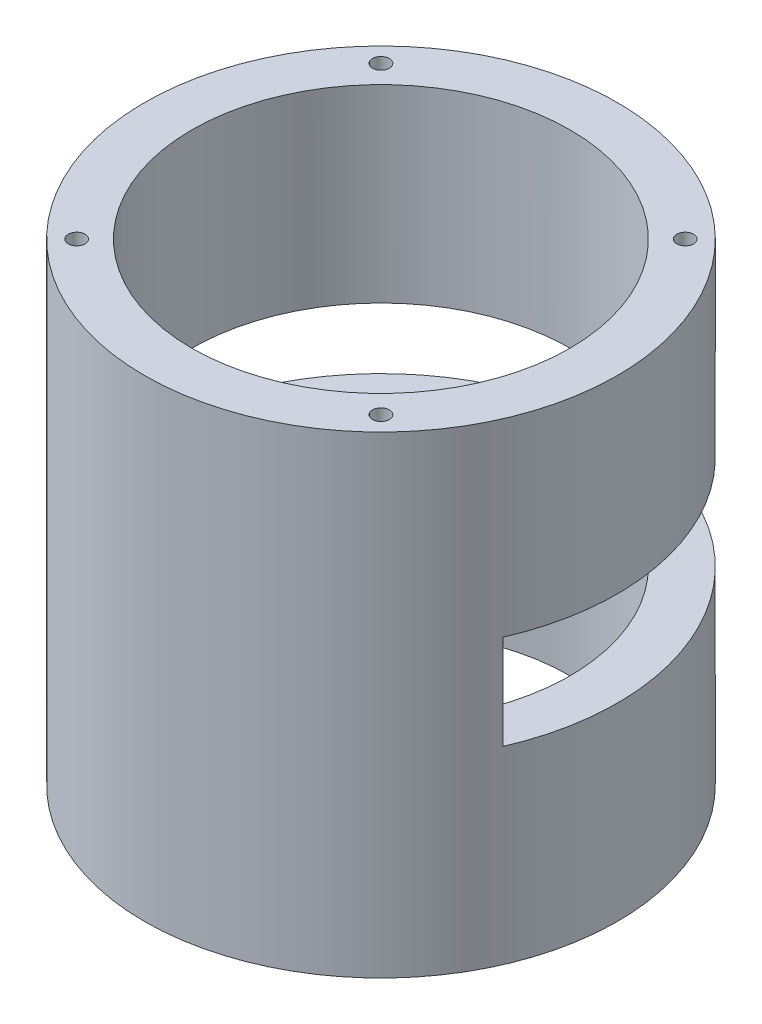
ISO-10303-21;
HEADER;
FILE_DESCRIPTION(('STEP AP214'),'2;1');
FILE_NAME('part.step','',(''),(''),'','','');
FILE_SCHEMA(('AUTOMOTIVE_DESIGN { 1 0 10303 214 1 1 1 1 }'));
ENDSEC;
DATA;
#1=APPLICATION_CONTEXT('core data for automotive mechanical design processes');
#2=APPLICATION_PROTOCOL_DEFINITION('international standard','automotive_design',2000,#1);
#3=PRODUCT_CONTEXT('',#1,'mechanical');
#4=PRODUCT('Part','Part','',(#3));
#5=PRODUCT_RELATED_PRODUCT_CATEGORY('part','',(#4));
#6=PRODUCT_DEFINITION_FORMATION('','',#4);
#7=PRODUCT_DEFINITION_CONTEXT('part definition',#1,'design');
#8=PRODUCT_DEFINITION('design','',#6,#7);
#9=PRODUCT_DEFINITION_SHAPE('','',#8);
#10=(LENGTH_UNIT() NAMED_UNIT(*) SI_UNIT(.MILLI.,.METRE.));
#11=(NAMED_UNIT(*) PLANE_ANGLE_UNIT() SI_UNIT($,.RADIAN.));
#12=(NAMED_UNIT(*) SI_UNIT($,.STERADIAN.) SOLID_ANGLE_UNIT());
#13=UNCERTAINTY_MEASURE_WITH_UNIT(LENGTH_MEASURE(1.E-05),#10,'distance_accuracy_value','');
#14=(GEOMETRIC_REPRESENTATION_CONTEXT(3) GLOBAL_UNCERTAINTY_ASSIGNED_CONTEXT((#13)) GLOBAL_UNIT_ASSIGNED_CONTEXT((#10,
#11,#12)) REPRESENTATION_CONTEXT('',''));
#15=CARTESIAN_POINT('',(0.,0.,0.));
#16=DIRECTION('',(0.,0.,1.));
#17=DIRECTION('',(1.,0.,0.));
#18=AXIS2_PLACEMENT_3D('',#15,#16,#17);
#19=CARTESIAN_POINT('',(0.,63.5,0.));
#20=DIRECTION('',(0.,1.,0.));
#21=DIRECTION('',(0.,0.,1.));
#22=AXIS2_PLACEMENT_3D('',#19,#20,#21);
#23=PLANE('',#22);
#24=CARTESIAN_POINT('',(-20.4300826754325,63.5,20.4300826754321));
#25=DIRECTION('',(0.,1.,0.));
#26=DIRECTION('',(0.,0.,1.));
#27=AXIS2_PLACEMENT_3D('',#24,#25,#26);
#28=CIRCLE('',#27,1.13029999999999);
#29=CARTESIAN_POINT('',(-20.4300826754325,63.5,21.5603826754321));
#30=VERTEX_POINT('',#29);
#31=EDGE_CURVE('E106',#30,#30,#28,.T.);
#32=ORIENTED_EDGE('',*,*,#31,.F.);
#33=EDGE_LOOP('',(#32));
#34=FACE_BOUND('',#33,.T.);
#35=CARTESIAN_POINT('',(20.4300826754322,63.5,20.4300826754324));
#36=DIRECTION('',(0.,1.,0.));
#37=DIRECTION('',(0.,0.,1.));
#38=AXIS2_PLACEMENT_3D('',#35,#36,#37);
#39=CIRCLE('',#38,1.13029999999999);
#40=CARTESIAN_POINT('',(20.4300826754322,63.5,21.5603826754324));
#41=VERTEX_POINT('',#40);
#42=EDGE_CURVE('E105',#41,#41,#39,.T.);
#43=ORIENTED_EDGE('',*,*,#42,.F.);
#44=EDGE_LOOP('',(#43));
#45=FACE_BOUND('',#44,.T.);
#46=CARTESIAN_POINT('',(20.4300826754325,63.5,-20.4300826754321));
#47=DIRECTION('',(0.,1.,0.));
#48=DIRECTION('',(0.,0.,1.));
#49=AXIS2_PLACEMENT_3D('',#46,#47,#48);
#50=CIRCLE('',#49,1.13029999999999);
#51=CARTESIAN_POINT('',(20.4300826754325,63.5,-19.2997826754321));
#52=VERTEX_POINT('',#51);
#53=EDGE_CURVE('E116',#52,#52,#50,.T.);
#54=ORIENTED_EDGE('',*,*,#53,.F.);
#55=EDGE_LOOP('',(#54));
#56=FACE_BOUND('',#55,.T.);
#57=CARTESIAN_POINT('',(-20.4300826754322,63.5,-20.4300826754324));
#58=DIRECTION('',(0.,1.,0.));
#59=DIRECTION('',(0.,0.,1.));
#60=AXIS2_PLACEMENT_3D('',#57,#58,#59);
#61=CIRCLE('',#60,1.13029999999999);
#62=CARTESIAN_POINT('',(-20.4300826754322,63.5,-19.2997826754324));
#63=VERTEX_POINT('',#62);
#64=EDGE_CURVE('E122',#63,#63,#61,.T.);
#65=ORIENTED_EDGE('',*,*,#64,.F.);
#66=EDGE_LOOP('',(#65));
#67=FACE_BOUND('',#66,.T.);
#68=CARTESIAN_POINT('',(0.,63.5,0.));
#69=DIRECTION('',(0.,1.,0.));
#70=DIRECTION('',(0.,0.,1.));
#71=AXIS2_PLACEMENT_3D('',#68,#69,#70);
#72=CIRCLE('',#71,31.75);
#73=CARTESIAN_POINT('',(0.,63.5,31.75));
#74=VERTEX_POINT('',#73);
#75=EDGE_CURVE('E173',#74,#74,#72,.T.);
#76=ORIENTED_EDGE('',*,*,#75,.T.);
#77=EDGE_LOOP('',(#76));
#78=FACE_BOUND('',#77,.T.);
#79=CARTESIAN_POINT('',(0.,63.5,0.));
#80=DIRECTION('',(0.,1.,0.));
#81=DIRECTION('',(0.,0.,1.));
#82=AXIS2_PLACEMENT_3D('',#79,#80,#81);
#83=CIRCLE('',#82,25.4);
#84=CARTESIAN_POINT('',(0.,63.5,25.4));
#85=VERTEX_POINT('',#84);
#86=EDGE_CURVE('E167',#85,#85,#83,.T.);
#87=ORIENTED_EDGE('',*,*,#86,.F.);
#88=EDGE_LOOP('',(#87));
#89=FACE_BOUND('',#88,.T.);
#90=ADVANCED_FACE('F34',(#34,#45,#56,#67,#78,#89),#23,.T.);
#91=CARTESIAN_POINT('',(0.,0.,0.));
#92=DIRECTION('',(0.,1.,0.));
#93=DIRECTION('',(0.,0.,1.));
#94=AXIS2_PLACEMENT_3D('',#91,#92,#93);
#95=PLANE('',#94);
#96=CARTESIAN_POINT('',(-20.4300826754325,0.,20.4300826754321));
#97=DIRECTION('',(0.,-1.,0.));
#98=DIRECTION('',(0.,0.,-1.));
#99=AXIS2_PLACEMENT_3D('',#96,#97,#98);
#100=CIRCLE('',#99,1.13029999999999);
#101=CARTESIAN_POINT('',(-20.4300826754325,0.,19.2997826754321));
#102=VERTEX_POINT('',#101);
#103=EDGE_CURVE('E142',#102,#102,#100,.T.);
#104=ORIENTED_EDGE('',*,*,#103,.F.);
#105=EDGE_LOOP('',(#104));
#106=FACE_BOUND('',#105,.T.);
#107=CARTESIAN_POINT('',(20.4300826754322,0.,20.4300826754324));
#108=DIRECTION('',(0.,-1.,0.));
#109=DIRECTION('',(0.,0.,-1.));
#110=AXIS2_PLACEMENT_3D('',#107,#108,#109);
#111=CIRCLE('',#110,1.13029999999999);
#112=CARTESIAN_POINT('',(20.4300826754322,0.,19.2997826754324));
#113=VERTEX_POINT('',#112);
#114=EDGE_CURVE('E148',#113,#113,#111,.T.);
#115=ORIENTED_EDGE('',*,*,#114,.F.);
#116=EDGE_LOOP('',(#115));
#117=FACE_BOUND('',#116,.T.);
#118=CARTESIAN_POINT('',(20.4300826754325,0.,-20.4300826754321));
#119=DIRECTION('',(0.,-1.,0.));
#120=DIRECTION('',(0.,0.,-1.));
#121=AXIS2_PLACEMENT_3D('',#118,#119,#120);
#122=CIRCLE('',#121,1.13029999999999);
#123=CARTESIAN_POINT('',(20.4300826754325,0.,-21.5603826754321));
#124=VERTEX_POINT('',#123);
#125=EDGE_CURVE('E154',#124,#124,#122,.T.);
#126=ORIENTED_EDGE('',*,*,#125,.F.);
#127=EDGE_LOOP('',(#126));
#128=FACE_BOUND('',#127,.T.);
#129=CARTESIAN_POINT('',(-20.4300826754322,0.,-20.4300826754324));
#130=DIRECTION('',(0.,-1.,0.));
#131=DIRECTION('',(0.,0.,-1.));
#132=AXIS2_PLACEMENT_3D('',#129,#130,#131);
#133=CIRCLE('',#132,1.13029999999999);
#134=CARTESIAN_POINT('',(-20.4300826754322,0.,-21.5603826754324));
#135=VERTEX_POINT('',#134);
#136=EDGE_CURVE('E160',#135,#135,#133,.T.);
#137=ORIENTED_EDGE('',*,*,#136,.F.);
#138=EDGE_LOOP('',(#137));
#139=FACE_BOUND('',#138,.T.);
#140=CARTESIAN_POINT('',(0.,0.,0.));
#141=DIRECTION('',(0.,1.,0.));
#142=DIRECTION('',(0.,0.,1.));
#143=AXIS2_PLACEMENT_3D('',#140,#141,#142);
#144=CIRCLE('',#143,31.75);
#145=CARTESIAN_POINT('',(0.,0.,31.75));
#146=VERTEX_POINT('',#145);
#147=EDGE_CURVE('E170',#146,#146,#144,.T.);
#148=ORIENTED_EDGE('',*,*,#147,.F.);
#149=EDGE_LOOP('',(#148));
#150=FACE_BOUND('',#149,.T.);
#151=CARTESIAN_POINT('',(0.,0.,0.));
#152=DIRECTION('',(0.,1.,0.));
#153=DIRECTION('',(0.,0.,1.));
#154=AXIS2_PLACEMENT_3D('',#151,#152,#153);
#155=CIRCLE('',#154,25.4);
#156=CARTESIAN_POINT('',(0.,0.,25.4));
#157=VERTEX_POINT('',#156);
#158=EDGE_CURVE('E166',#157,#157,#155,.T.);
#159=ORIENTED_EDGE('',*,*,#158,.T.);
#160=EDGE_LOOP('',(#159));
#161=FACE_BOUND('',#160,.T.);
#162=ADVANCED_FACE('F214',(#106,#117,#128,#139,#150,#161),#95,.F.);
#163=CARTESIAN_POINT('',(0.,63.5,0.));
#164=DIRECTION('',(0.,-1.,0.));
#165=DIRECTION('',(0.,0.,-1.));
#166=AXIS2_PLACEMENT_3D('',#163,#164,#165);
#167=CYLINDRICAL_SURFACE('',#166,31.75);
#168=DIRECTION('',(0.,-1.,0.));
#169=VECTOR('',#168,1.);
#170=CARTESIAN_POINT('',(29.0993556629696,63.5,12.7));
#171=LINE('',#170,#169);
#172=CARTESIAN_POINT('',(29.0993556629696,38.1,12.7));
#173=VERTEX_POINT('',#172);
#174=CARTESIAN_POINT('',(29.0993556629696,25.4,12.7));
#175=VERTEX_POINT('',#174);
#176=EDGE_CURVE('E140',#173,#175,#171,.T.);
#177=ORIENTED_EDGE('',*,*,#176,.F.);
#178=CARTESIAN_POINT('',(0.,38.1,0.));
#179=DIRECTION('',(0.,1.,0.));
#180=DIRECTION('',(0.,0.,1.));
#181=AXIS2_PLACEMENT_3D('',#178,#179,#180);
#182=CIRCLE('',#181,31.75);
#183=CARTESIAN_POINT('',(-29.0993556629696,38.1,12.7));
#184=VERTEX_POINT('',#183);
#185=EDGE_CURVE('E135',#173,#184,#182,.T.);
#186=ORIENTED_EDGE('',*,*,#185,.T.);
#187=DIRECTION('',(0.,-1.,0.));
#188=VECTOR('',#187,1.);
#189=CARTESIAN_POINT('',(-29.0993556629696,63.5,12.7));
#190=LINE('',#189,#188);
#191=CARTESIAN_POINT('',(-29.0993556629696,25.4,12.7));
#192=VERTEX_POINT('',#191);
#193=EDGE_CURVE('E138',#192,#184,#190,.F.);
#194=ORIENTED_EDGE('',*,*,#193,.F.);
#195=CARTESIAN_POINT('',(0.,25.4,0.));
#196=DIRECTION('',(0.,1.,0.));
#197=DIRECTION('',(0.,0.,1.));
#198=AXIS2_PLACEMENT_3D('',#195,#196,#197);
#199=CIRCLE('',#198,31.75);
#200=EDGE_CURVE('E133',#175,#192,#199,.T.);
#201=ORIENTED_EDGE('',*,*,#200,.F.);
#202=EDGE_LOOP('',(#177,#186,#194,#201));
#203=FACE_BOUND('',#202,.T.);
#204=ORIENTED_EDGE('',*,*,#75,.F.);
#205=EDGE_LOOP('',(#204));
#206=FACE_BOUND('',#205,.T.);
#207=ORIENTED_EDGE('',*,*,#147,.T.);
#208=EDGE_LOOP('',(#207));
#209=FACE_BOUND('',#208,.T.);
#210=ADVANCED_FACE('F36',(#203,#206,#209),#167,.T.);
#211=CARTESIAN_POINT('',(0.,63.5,0.));
#212=DIRECTION('',(0.,-1.,0.));
#213=DIRECTION('',(0.,0.,-1.));
#214=AXIS2_PLACEMENT_3D('',#211,#212,#213);
#215=CYLINDRICAL_SURFACE('',#214,25.4);
#216=CARTESIAN_POINT('',(0.,38.1,0.));
#217=DIRECTION('',(0.,1.,0.));
#218=DIRECTION('',(0.,0.,1.));
#219=AXIS2_PLACEMENT_3D('',#216,#217,#218);
#220=CIRCLE('',#219,25.4);
#221=CARTESIAN_POINT('',(21.9970452561247,38.1,12.7));
#222=VERTEX_POINT('',#221);
#223=CARTESIAN_POINT('',(-21.9970452561247,38.1,12.7));
#224=VERTEX_POINT('',#223);
#225=EDGE_CURVE('E11',#222,#224,#220,.T.);
#226=ORIENTED_EDGE('',*,*,#225,.F.);
#227=DIRECTION('',(0.,-1.,0.));
#228=VECTOR('',#227,1.);
#229=CARTESIAN_POINT('',(21.9970452561247,63.5,12.7));
#230=LINE('',#229,#228);
#231=CARTESIAN_POINT('',(21.9970452561247,25.4,12.7));
#232=VERTEX_POINT('',#231);
#233=EDGE_CURVE('E42',#222,#232,#230,.T.);
#234=ORIENTED_EDGE('',*,*,#233,.T.);
#235=CARTESIAN_POINT('',(0.,25.4,0.));
#236=DIRECTION('',(0.,1.,0.));
#237=DIRECTION('',(0.,0.,1.));
#238=AXIS2_PLACEMENT_3D('',#235,#236,#237);
#239=CIRCLE('',#238,25.4);
#240=CARTESIAN_POINT('',(-21.9970452561247,25.4,12.7));
#241=VERTEX_POINT('',#240);
#242=EDGE_CURVE('E176',#232,#241,#239,.T.);
#243=ORIENTED_EDGE('',*,*,#242,.T.);
#244=DIRECTION('',(0.,-1.,0.));
#245=VECTOR('',#244,1.);
#246=CARTESIAN_POINT('',(-21.9970452561247,63.5,12.7));
#247=LINE('',#246,#245);
#248=EDGE_CURVE('E181',#241,#224,#247,.F.);
#249=ORIENTED_EDGE('',*,*,#248,.T.);
#250=EDGE_LOOP('',(#226,#234,#243,#249));
#251=FACE_BOUND('',#250,.T.);
#252=ORIENTED_EDGE('',*,*,#86,.T.);
#253=EDGE_LOOP('',(#252));
#254=FACE_BOUND('',#253,.T.);
#255=ORIENTED_EDGE('',*,*,#158,.F.);
#256=EDGE_LOOP('',(#255));
#257=FACE_BOUND('',#256,.T.);
#258=ADVANCED_FACE('F186',(#251,#254,#257),#215,.F.);
#259=CARTESIAN_POINT('',(-20.4300826754322,7.62,-20.4300826754324));
#260=DIRECTION('',(0.,-1.,0.));
#261=DIRECTION('',(0.,0.,-1.));
#262=AXIS2_PLACEMENT_3D('',#259,#260,#261);
#263=CONICAL_SURFACE('',#262,1.13029999999999,1.02974425867665);
#264=CARTESIAN_POINT('',(-20.4300826754322,8.29915275768685,-20.4300826754324));
#265=VERTEX_POINT('',#264);
#266=VERTEX_LOOP('',#265);
#267=FACE_BOUND('',#266,.T.);
#268=CARTESIAN_POINT('',(-20.4300826754322,7.62,-20.4300826754324));
#269=DIRECTION('',(0.,-1.,0.));
#270=DIRECTION('',(0.,0.,-1.));
#271=AXIS2_PLACEMENT_3D('',#268,#269,#270);
#272=CIRCLE('',#271,1.13029999999999);
#273=CARTESIAN_POINT('',(-20.4300826754322,7.62,-21.5603826754324));
#274=VERTEX_POINT('',#273);
#275=EDGE_CURVE('E163',#274,#274,#272,.T.);
#276=ORIENTED_EDGE('',*,*,#275,.T.);
#277=EDGE_LOOP('',(#276));
#278=FACE_BOUND('',#277,.T.);
#279=ADVANCED_FACE('F226',(#267,#278),#263,.F.);
#280=CARTESIAN_POINT('',(-20.4300826754322,0.,-20.4300826754324));
#281=DIRECTION('',(0.,-1.,0.));
#282=DIRECTION('',(0.,0.,-1.));
#283=AXIS2_PLACEMENT_3D('',#280,#281,#282);
#284=CYLINDRICAL_SURFACE('',#283,1.13029999999999);
#285=ORIENTED_EDGE('',*,*,#275,.F.);
#286=EDGE_LOOP('',(#285));
#287=FACE_BOUND('',#286,.T.);
#288=ORIENTED_EDGE('',*,*,#136,.T.);
#289=EDGE_LOOP('',(#288));
#290=FACE_BOUND('',#289,.T.);
#291=ADVANCED_FACE('F229',(#287,#290),#284,.F.);
#292=CARTESIAN_POINT('',(20.4300826754325,7.62,-20.4300826754321));
#293=DIRECTION('',(0.,-1.,0.));
#294=DIRECTION('',(0.,0.,-1.));
#295=AXIS2_PLACEMENT_3D('',#292,#293,#294);
#296=CONICAL_SURFACE('',#295,1.13029999999999,1.02974425867665);
#297=CARTESIAN_POINT('',(20.4300826754325,8.29915275768685,-20.4300826754321));
#298=VERTEX_POINT('',#297);
#299=VERTEX_LOOP('',#298);
#300=FACE_BOUND('',#299,.T.);
#301=CARTESIAN_POINT('',(20.4300826754325,7.62,-20.4300826754321));
#302=DIRECTION('',(0.,-1.,0.));
#303=DIRECTION('',(0.,0.,-1.));
#304=AXIS2_PLACEMENT_3D('',#301,#302,#303);
#305=CIRCLE('',#304,1.13029999999999);
#306=CARTESIAN_POINT('',(20.4300826754325,7.62,-21.5603826754321));
#307=VERTEX_POINT('',#306);
#308=EDGE_CURVE('E157',#307,#307,#305,.T.);
#309=ORIENTED_EDGE('',*,*,#308,.T.);
#310=EDGE_LOOP('',(#309));
#311=FACE_BOUND('',#310,.T.);
#312=ADVANCED_FACE('F233',(#300,#311),#296,.F.);
#313=CARTESIAN_POINT('',(20.4300826754325,0.,-20.4300826754321));
#314=DIRECTION('',(0.,-1.,0.));
#315=DIRECTION('',(0.,0.,-1.));
#316=AXIS2_PLACEMENT_3D('',#313,#314,#315);
#317=CYLINDRICAL_SURFACE('',#316,1.13029999999999);
#318=ORIENTED_EDGE('',*,*,#308,.F.);
#319=EDGE_LOOP('',(#318));
#320=FACE_BOUND('',#319,.T.);
#321=ORIENTED_EDGE('',*,*,#125,.T.);
#322=EDGE_LOOP('',(#321));
#323=FACE_BOUND('',#322,.T.);
#324=ADVANCED_FACE('F237',(#320,#323),#317,.F.);
#325=CARTESIAN_POINT('',(20.4300826754322,7.62,20.4300826754324));
#326=DIRECTION('',(0.,-1.,0.));
#327=DIRECTION('',(0.,0.,-1.));
#328=AXIS2_PLACEMENT_3D('',#325,#326,#327);
#329=CONICAL_SURFACE('',#328,1.13029999999999,1.02974425867665);
#330=CARTESIAN_POINT('',(20.4300826754322,8.29915275768685,20.4300826754324));
#331=VERTEX_POINT('',#330);
#332=VERTEX_LOOP('',#331);
#333=FACE_BOUND('',#332,.T.);
#334=CARTESIAN_POINT('',(20.4300826754322,7.62,20.4300826754324));
#335=DIRECTION('',(0.,-1.,0.));
#336=DIRECTION('',(0.,0.,-1.));
#337=AXIS2_PLACEMENT_3D('',#334,#335,#336);
#338=CIRCLE('',#337,1.13029999999999);
#339=CARTESIAN_POINT('',(20.4300826754322,7.62,19.2997826754324));
#340=VERTEX_POINT('',#339);
#341=EDGE_CURVE('E151',#340,#340,#338,.T.);
#342=ORIENTED_EDGE('',*,*,#341,.T.);
#343=EDGE_LOOP('',(#342));
#344=FACE_BOUND('',#343,.T.);
#345=ADVANCED_FACE('F241',(#333,#344),#329,.F.);
#346=CARTESIAN_POINT('',(20.4300826754322,0.,20.4300826754324));
#347=DIRECTION('',(0.,-1.,0.));
#348=DIRECTION('',(0.,0.,-1.));
#349=AXIS2_PLACEMENT_3D('',#346,#347,#348);
#350=CYLINDRICAL_SURFACE('',#349,1.13029999999999);
#351=ORIENTED_EDGE('',*,*,#341,.F.);
#352=EDGE_LOOP('',(#351));
#353=FACE_BOUND('',#352,.T.);
#354=ORIENTED_EDGE('',*,*,#114,.T.);
#355=EDGE_LOOP('',(#354));
#356=FACE_BOUND('',#355,.T.);
#357=ADVANCED_FACE('F245',(#353,#356),#350,.F.);
#358=CARTESIAN_POINT('',(-20.4300826754325,7.62,20.4300826754321));
#359=DIRECTION('',(0.,-1.,0.));
#360=DIRECTION('',(0.,0.,-1.));
#361=AXIS2_PLACEMENT_3D('',#358,#359,#360);
#362=CONICAL_SURFACE('',#361,1.13029999999999,1.02974425867665);
#363=CARTESIAN_POINT('',(-20.4300826754325,8.29915275768685,20.4300826754321));
#364=VERTEX_POINT('',#363);
#365=VERTEX_LOOP('',#364);
#366=FACE_BOUND('',#365,.T.);
#367=CARTESIAN_POINT('',(-20.4300826754325,7.62,20.4300826754321));
#368=DIRECTION('',(0.,-1.,0.));
#369=DIRECTION('',(0.,0.,-1.));
#370=AXIS2_PLACEMENT_3D('',#367,#368,#369);
#371=CIRCLE('',#370,1.13029999999999);
#372=CARTESIAN_POINT('',(-20.4300826754325,7.62,19.2997826754321));
#373=VERTEX_POINT('',#372);
#374=EDGE_CURVE('E145',#373,#373,#371,.T.);
#375=ORIENTED_EDGE('',*,*,#374,.T.);
#376=EDGE_LOOP('',(#375));
#377=FACE_BOUND('',#376,.T.);
#378=ADVANCED_FACE('F249',(#366,#377),#362,.F.);
#379=CARTESIAN_POINT('',(-20.4300826754325,0.,20.4300826754321));
#380=DIRECTION('',(0.,-1.,0.));
#381=DIRECTION('',(0.,0.,-1.));
#382=AXIS2_PLACEMENT_3D('',#379,#380,#381);
#383=CYLINDRICAL_SURFACE('',#382,1.13029999999999);
#384=ORIENTED_EDGE('',*,*,#374,.F.);
#385=EDGE_LOOP('',(#384));
#386=FACE_BOUND('',#385,.T.);
#387=ORIENTED_EDGE('',*,*,#103,.T.);
#388=EDGE_LOOP('',(#387));
#389=FACE_BOUND('',#388,.T.);
#390=ADVANCED_FACE('F210',(#386,#389),#383,.F.);
#391=CARTESIAN_POINT('',(-54.713958005717,38.1,12.7));
#392=DIRECTION('',(0.,0.,-1.));
#393=DIRECTION('',(-1.,0.,0.));
#394=AXIS2_PLACEMENT_3D('',#391,#392,#393);
#395=PLANE('',#394);
#396=ORIENTED_EDGE('',*,*,#176,.T.);
#397=DIRECTION('',(1.,0.,0.));
#398=VECTOR('',#397,1.);
#399=CARTESIAN_POINT('',(-54.713958005717,25.4,12.7));
#400=LINE('',#399,#398);
#401=EDGE_CURVE('E49',#232,#175,#400,.T.);
#402=ORIENTED_EDGE('',*,*,#401,.F.);
#403=ORIENTED_EDGE('',*,*,#233,.F.);
#404=DIRECTION('',(1.,0.,0.));
#405=VECTOR('',#404,1.);
#406=CARTESIAN_POINT('',(-54.713958005717,38.1,12.7));
#407=LINE('',#406,#405);
#408=EDGE_CURVE('E128',#222,#173,#407,.T.);
#409=ORIENTED_EDGE('',*,*,#408,.T.);
#410=EDGE_LOOP('',(#396,#402,#403,#409));
#411=FACE_BOUND('',#410,.T.);
#412=ADVANCED_FACE('F190',(#411),#395,.T.);
#413=ORIENTED_EDGE('',*,*,#193,.T.);
#414=EDGE_CURVE('E131',#184,#224,#407,.T.);
#415=ORIENTED_EDGE('',*,*,#414,.T.);
#416=ORIENTED_EDGE('',*,*,#248,.F.);
#417=EDGE_CURVE('E54',#192,#241,#400,.T.);
#418=ORIENTED_EDGE('',*,*,#417,.F.);
#419=EDGE_LOOP('',(#413,#415,#416,#418));
#420=FACE_BOUND('',#419,.T.);
#421=ADVANCED_FACE('F202',(#420),#395,.T.);
#422=CARTESIAN_POINT('',(0.,38.1,0.));
#423=DIRECTION('',(0.,1.,0.));
#424=DIRECTION('',(0.,0.,1.));
#425=AXIS2_PLACEMENT_3D('',#422,#423,#424);
#426=PLANE('',#425);
#427=ORIENTED_EDGE('',*,*,#408,.F.);
#428=ORIENTED_EDGE('',*,*,#225,.T.);
#429=ORIENTED_EDGE('',*,*,#414,.F.);
#430=ORIENTED_EDGE('',*,*,#185,.F.);
#431=EDGE_LOOP('',(#427,#428,#429,#430));
#432=FACE_BOUND('',#431,.T.);
#433=ADVANCED_FACE('F193',(#432),#426,.F.);
#434=CARTESIAN_POINT('',(0.,25.4,0.));
#435=DIRECTION('',(0.,1.,0.));
#436=DIRECTION('',(0.,0.,1.));
#437=AXIS2_PLACEMENT_3D('',#434,#435,#436);
#438=PLANE('',#437);
#439=ORIENTED_EDGE('',*,*,#200,.T.);
#440=ORIENTED_EDGE('',*,*,#417,.T.);
#441=ORIENTED_EDGE('',*,*,#242,.F.);
#442=ORIENTED_EDGE('',*,*,#401,.T.);
#443=EDGE_LOOP('',(#439,#440,#441,#442));
#444=FACE_BOUND('',#443,.T.);
#445=ADVANCED_FACE('F200',(#444),#438,.T.);
#446=CARTESIAN_POINT('',(-20.4300826754322,55.88,-20.4300826754324));
#447=DIRECTION('',(0.,1.,0.));
#448=DIRECTION('',(0.,0.,1.));
#449=AXIS2_PLACEMENT_3D('',#446,#447,#448);
#450=CONICAL_SURFACE('',#449,1.13029999999999,1.02974425867665);
#451=CARTESIAN_POINT('',(-20.4300826754322,55.2008472423132,-20.4300826754324));
#452=VERTEX_POINT('',#451);
#453=VERTEX_LOOP('',#452);
#454=FACE_BOUND('',#453,.T.);
#455=CARTESIAN_POINT('',(-20.4300826754322,55.88,-20.4300826754324));
#456=DIRECTION('',(0.,1.,0.));
#457=DIRECTION('',(0.,0.,1.));
#458=AXIS2_PLACEMENT_3D('',#455,#456,#457);
#459=CIRCLE('',#458,1.13029999999999);
#460=CARTESIAN_POINT('',(-20.4300826754322,55.88,-19.2997826754324));
#461=VERTEX_POINT('',#460);
#462=EDGE_CURVE('E125',#461,#461,#459,.T.);
#463=ORIENTED_EDGE('',*,*,#462,.T.);
#464=EDGE_LOOP('',(#463));
#465=FACE_BOUND('',#464,.T.);
#466=ADVANCED_FACE('F337',(#454,#465),#450,.F.);
#467=CARTESIAN_POINT('',(-20.4300826754322,63.5,-20.4300826754324));
#468=DIRECTION('',(0.,1.,0.));
#469=DIRECTION('',(0.,0.,1.));
#470=AXIS2_PLACEMENT_3D('',#467,#468,#469);
#471=CYLINDRICAL_SURFACE('',#470,1.13029999999999);
#472=ORIENTED_EDGE('',*,*,#462,.F.);
#473=EDGE_LOOP('',(#472));
#474=FACE_BOUND('',#473,.T.);
#475=ORIENTED_EDGE('',*,*,#64,.T.);
#476=EDGE_LOOP('',(#475));
#477=FACE_BOUND('',#476,.T.);
#478=ADVANCED_FACE('F344',(#474,#477),#471,.F.);
#479=CARTESIAN_POINT('',(20.4300826754325,55.88,-20.4300826754321));
#480=DIRECTION('',(0.,1.,0.));
#481=DIRECTION('',(0.,0.,1.));
#482=AXIS2_PLACEMENT_3D('',#479,#480,#481);
#483=CONICAL_SURFACE('',#482,1.13029999999999,1.02974425867665);
#484=CARTESIAN_POINT('',(20.4300826754325,55.2008472423132,-20.4300826754321));
#485=VERTEX_POINT('',#484);
#486=VERTEX_LOOP('',#485);
#487=FACE_BOUND('',#486,.T.);
#488=CARTESIAN_POINT('',(20.4300826754325,55.88,-20.4300826754321));
#489=DIRECTION('',(0.,1.,0.));
#490=DIRECTION('',(0.,0.,1.));
#491=AXIS2_PLACEMENT_3D('',#488,#489,#490);
#492=CIRCLE('',#491,1.13029999999999);
#493=CARTESIAN_POINT('',(20.4300826754325,55.88,-19.2997826754321));
#494=VERTEX_POINT('',#493);
#495=EDGE_CURVE('E119',#494,#494,#492,.T.);
#496=ORIENTED_EDGE('',*,*,#495,.T.);
#497=EDGE_LOOP('',(#496));
#498=FACE_BOUND('',#497,.T.);
#499=ADVANCED_FACE('F353',(#487,#498),#483,.F.);
#500=CARTESIAN_POINT('',(20.4300826754325,63.5,-20.4300826754321));
#501=DIRECTION('',(0.,1.,0.));
#502=DIRECTION('',(0.,0.,1.));
#503=AXIS2_PLACEMENT_3D('',#500,#501,#502);
#504=CYLINDRICAL_SURFACE('',#503,1.13029999999999);
#505=ORIENTED_EDGE('',*,*,#495,.F.);
#506=EDGE_LOOP('',(#505));
#507=FACE_BOUND('',#506,.T.);
#508=ORIENTED_EDGE('',*,*,#53,.T.);
#509=EDGE_LOOP('',(#508));
#510=FACE_BOUND('',#509,.T.);
#511=ADVANCED_FACE('F362',(#507,#510),#504,.F.);
#512=CARTESIAN_POINT('',(20.4300826754322,55.88,20.4300826754324));
#513=DIRECTION('',(0.,1.,0.));
#514=DIRECTION('',(0.,0.,1.));
#515=AXIS2_PLACEMENT_3D('',#512,#513,#514);
#516=CONICAL_SURFACE('',#515,1.13029999999999,1.02974425867665);
#517=CARTESIAN_POINT('',(20.4300826754322,55.2008472423132,20.4300826754324));
#518=VERTEX_POINT('',#517);
#519=VERTEX_LOOP('',#518);
#520=FACE_BOUND('',#519,.T.);
#521=CARTESIAN_POINT('',(20.4300826754322,55.88,20.4300826754324));
#522=DIRECTION('',(0.,1.,0.));
#523=DIRECTION('',(0.,0.,1.));
#524=AXIS2_PLACEMENT_3D('',#521,#522,#523);
#525=CIRCLE('',#524,1.13029999999999);
#526=CARTESIAN_POINT('',(20.4300826754322,55.88,21.5603826754324));
#527=VERTEX_POINT('',#526);
#528=EDGE_CURVE('E109',#527,#527,#525,.T.);
#529=ORIENTED_EDGE('',*,*,#528,.T.);
#530=EDGE_LOOP('',(#529));
#531=FACE_BOUND('',#530,.T.);
#532=ADVANCED_FACE('F371',(#520,#531),#516,.F.);
#533=CARTESIAN_POINT('',(20.4300826754322,63.5,20.4300826754324));
#534=DIRECTION('',(0.,1.,0.));
#535=DIRECTION('',(0.,0.,1.));
#536=AXIS2_PLACEMENT_3D('',#533,#534,#535);
#537=CYLINDRICAL_SURFACE('',#536,1.13029999999999);
#538=ORIENTED_EDGE('',*,*,#528,.F.);
#539=EDGE_LOOP('',(#538));
#540=FACE_BOUND('',#539,.T.);
#541=ORIENTED_EDGE('',*,*,#42,.T.);
#542=EDGE_LOOP('',(#541));
#543=FACE_BOUND('',#542,.T.);
#544=ADVANCED_FACE('F99',(#540,#543),#537,.F.);
#545=CARTESIAN_POINT('',(-20.4300826754325,55.88,20.4300826754321));
#546=DIRECTION('',(0.,1.,0.));
#547=DIRECTION('',(0.,0.,1.));
#548=AXIS2_PLACEMENT_3D('',#545,#546,#547);
#549=CONICAL_SURFACE('',#548,1.13029999999999,1.02974425867665);
#550=CARTESIAN_POINT('',(-20.4300826754325,55.2008472423132,20.4300826754321));
#551=VERTEX_POINT('',#550);
#552=VERTEX_LOOP('',#551);
#553=FACE_BOUND('',#552,.T.);
#554=CARTESIAN_POINT('',(-20.4300826754325,55.88,20.4300826754321));
#555=DIRECTION('',(0.,1.,0.));
#556=DIRECTION('',(0.,0.,1.));
#557=AXIS2_PLACEMENT_3D('',#554,#555,#556);
#558=CIRCLE('',#557,1.13029999999999);
#559=CARTESIAN_POINT('',(-20.4300826754325,55.88,21.5603826754321));
#560=VERTEX_POINT('',#559);
#561=EDGE_CURVE('E103',#560,#560,#558,.T.);
#562=ORIENTED_EDGE('',*,*,#561,.T.);
#563=EDGE_LOOP('',(#562));
#564=FACE_BOUND('',#563,.T.);
#565=ADVANCED_FACE('F95',(#553,#564),#549,.F.);
#566=CARTESIAN_POINT('',(-20.4300826754325,63.5,20.4300826754321));
#567=DIRECTION('',(0.,1.,0.));
#568=DIRECTION('',(0.,0.,1.));
#569=AXIS2_PLACEMENT_3D('',#566,#567,#568);
#570=CYLINDRICAL_SURFACE('',#569,1.13029999999999);
#571=ORIENTED_EDGE('',*,*,#561,.F.);
#572=EDGE_LOOP('',(#571));
#573=FACE_BOUND('',#572,.T.);
#574=ORIENTED_EDGE('',*,*,#31,.T.);
#575=EDGE_LOOP('',(#574));
#576=FACE_BOUND('',#575,.T.);
#577=ADVANCED_FACE('F98',(#573,#576),#570,.F.);
#578=CLOSED_SHELL('',(#90,#162,#210,#258,#279,#291,#312,#324,#345,#357,#378,#390,#412,#421,#433,
#445,#466,#478,#499,#511,#532,#544,#565,#577));
#579=MANIFOLD_SOLID_BREP('B2',#578);
#580=ADVANCED_BREP_SHAPE_REPRESENTATION('',(#18,#579),#14);
#581=SHAPE_DEFINITION_REPRESENTATION(#9,#580);
ENDSEC;
END-ISO-10303-21;
